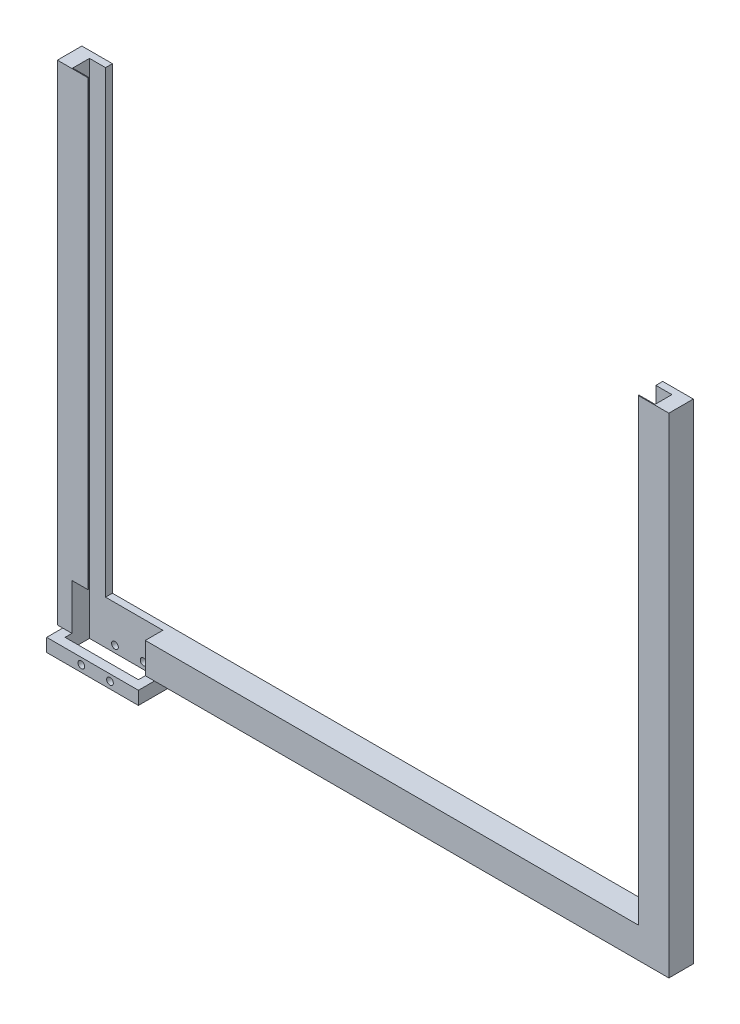
ISO-10303-21;
HEADER;
FILE_DESCRIPTION(('STEP AP214'),'2;1');
FILE_NAME('part.step','',(''),(''),'','','');
FILE_SCHEMA(('AUTOMOTIVE_DESIGN { 1 0 10303 214 1 1 1 1 }'));
ENDSEC;
DATA;
#1=APPLICATION_CONTEXT('core data for automotive mechanical design processes');
#2=APPLICATION_PROTOCOL_DEFINITION('international standard','automotive_design',2000,#1);
#3=PRODUCT_CONTEXT('',#1,'mechanical');
#4=PRODUCT('Part','Part','',(#3));
#5=PRODUCT_RELATED_PRODUCT_CATEGORY('part','',(#4));
#6=PRODUCT_DEFINITION_FORMATION('','',#4);
#7=PRODUCT_DEFINITION_CONTEXT('part definition',#1,'design');
#8=PRODUCT_DEFINITION('design','',#6,#7);
#9=PRODUCT_DEFINITION_SHAPE('','',#8);
#10=(LENGTH_UNIT() NAMED_UNIT(*) SI_UNIT(.MILLI.,.METRE.));
#11=(NAMED_UNIT(*) PLANE_ANGLE_UNIT() SI_UNIT($,.RADIAN.));
#12=(NAMED_UNIT(*) SI_UNIT($,.STERADIAN.) SOLID_ANGLE_UNIT());
#13=UNCERTAINTY_MEASURE_WITH_UNIT(LENGTH_MEASURE(1.E-05),#10,'distance_accuracy_value','');
#14=(GEOMETRIC_REPRESENTATION_CONTEXT(3) GLOBAL_UNCERTAINTY_ASSIGNED_CONTEXT((#13)) GLOBAL_UNIT_ASSIGNED_CONTEXT((#10,
#11,#12)) REPRESENTATION_CONTEXT('',''));
#15=CARTESIAN_POINT('',(0.,0.,0.));
#16=DIRECTION('',(0.,0.,1.));
#17=DIRECTION('',(1.,0.,0.));
#18=AXIS2_PLACEMENT_3D('',#15,#16,#17);
#19=CARTESIAN_POINT('',(0.,160.,0.));
#20=DIRECTION('',(0.,1.,0.));
#21=DIRECTION('',(0.,0.,1.));
#22=AXIS2_PLACEMENT_3D('',#19,#20,#21);
#23=PLANE('',#22);
#24=DIRECTION('',(-1.,0.,0.));
#25=VECTOR('',#24,1.);
#26=CARTESIAN_POINT('',(-99.9999999999999,160.,-77.));
#27=LINE('',#26,#25);
#28=CARTESIAN_POINT('',(100.,160.,-77.));
#29=VERTEX_POINT('',#28);
#30=CARTESIAN_POINT('',(89.9999999999999,160.,-77.));
#31=VERTEX_POINT('',#30);
#32=EDGE_CURVE('E11',#29,#31,#27,.T.);
#33=ORIENTED_EDGE('',*,*,#32,.F.);
#34=DIRECTION('',(0.,0.,-1.));
#35=VECTOR('',#34,1.);
#36=CARTESIAN_POINT('',(100.,160.,0.));
#37=LINE('',#36,#35);
#38=CARTESIAN_POINT('',(100.,160.,-85.));
#39=VERTEX_POINT('',#38);
#40=EDGE_CURVE('E451',#29,#39,#37,.T.);
#41=ORIENTED_EDGE('',*,*,#40,.T.);
#42=DIRECTION('',(-1.,0.,0.));
#43=VECTOR('',#42,1.);
#44=CARTESIAN_POINT('',(0.,160.,-85.));
#45=LINE('',#44,#43);
#46=CARTESIAN_POINT('',(89.9999999999999,160.,-85.));
#47=VERTEX_POINT('',#46);
#48=EDGE_CURVE('E448',#39,#47,#45,.T.);
#49=ORIENTED_EDGE('',*,*,#48,.T.);
#50=DIRECTION('',(0.,0.,-1.));
#51=VECTOR('',#50,1.);
#52=CARTESIAN_POINT('',(89.9999999999999,160.,0.));
#53=LINE('',#52,#51);
#54=CARTESIAN_POINT('',(89.9999999999999,160.,-82.75));
#55=VERTEX_POINT('',#54);
#56=EDGE_CURVE('E408',#55,#47,#53,.T.);
#57=ORIENTED_EDGE('',*,*,#56,.F.);
#58=DIRECTION('',(1.,0.,0.));
#59=VECTOR('',#58,1.);
#60=CARTESIAN_POINT('',(0.,160.,-82.75));
#61=LINE('',#60,#59);
#62=CARTESIAN_POINT('',(95.2499999999999,160.,-82.75));
#63=VERTEX_POINT('',#62);
#64=EDGE_CURVE('E365',#55,#63,#61,.T.);
#65=ORIENTED_EDGE('',*,*,#64,.T.);
#66=DIRECTION('',(0.,0.,-1.));
#67=VECTOR('',#66,1.);
#68=CARTESIAN_POINT('',(95.2500000000001,160.,-2.40338052489878E-13));
#69=LINE('',#68,#67);
#70=CARTESIAN_POINT('',(95.2499999999999,160.,-77.25));
#71=VERTEX_POINT('',#70);
#72=EDGE_CURVE('E401',#71,#63,#69,.T.);
#73=ORIENTED_EDGE('',*,*,#72,.F.);
#74=DIRECTION('',(1.,0.,0.));
#75=VECTOR('',#74,1.);
#76=CARTESIAN_POINT('',(0.,160.,-77.25));
#77=LINE('',#76,#75);
#78=CARTESIAN_POINT('',(89.9999999999999,160.,-77.25));
#79=VERTEX_POINT('',#78);
#80=EDGE_CURVE('E456',#79,#71,#77,.T.);
#81=ORIENTED_EDGE('',*,*,#80,.F.);
#82=EDGE_CURVE('E404',#31,#79,#53,.T.);
#83=ORIENTED_EDGE('',*,*,#82,.F.);
#84=EDGE_LOOP('',(#33,#41,#49,#57,#65,#73,#81,#83));
#85=FACE_BOUND('',#84,.T.);
#86=ADVANCED_FACE('F38',(#85),#23,.T.);
#87=CARTESIAN_POINT('',(0.,0.,0.));
#88=DIRECTION('',(0.,-1.,0.));
#89=DIRECTION('',(0.,0.,-1.));
#90=AXIS2_PLACEMENT_3D('',#87,#88,#89);
#91=PLANE('',#90);
#92=DIRECTION('',(1.,0.,0.));
#93=VECTOR('',#92,1.);
#94=CARTESIAN_POINT('',(100.,0.,-77.));
#95=LINE('',#94,#93);
#96=CARTESIAN_POINT('',(-99.9999999999999,0.,-77.));
#97=VERTEX_POINT('',#96);
#98=CARTESIAN_POINT('',(-98.2499999999999,0.,-77.));
#99=VERTEX_POINT('',#98);
#100=EDGE_CURVE('E42',#97,#99,#95,.T.);
#101=ORIENTED_EDGE('',*,*,#100,.F.);
#102=DIRECTION('',(0.,0.,1.));
#103=VECTOR('',#102,1.);
#104=CARTESIAN_POINT('',(-99.9999999999999,0.,85.));
#105=LINE('',#104,#103);
#106=CARTESIAN_POINT('',(-99.9999999999999,0.,-85.));
#107=VERTEX_POINT('',#106);
#108=EDGE_CURVE('E416',#107,#97,#105,.T.);
#109=ORIENTED_EDGE('',*,*,#108,.F.);
#110=DIRECTION('',(-1.,0.,0.));
#111=VECTOR('',#110,1.);
#112=CARTESIAN_POINT('',(-99.9999999999999,0.,-85.));
#113=LINE('',#112,#111);
#114=CARTESIAN_POINT('',(-98.2499999999999,0.,-85.));
#115=VERTEX_POINT('',#114);
#116=EDGE_CURVE('E427',#115,#107,#113,.T.);
#117=ORIENTED_EDGE('',*,*,#116,.F.);
#118=DIRECTION('',(0.,0.,-1.));
#119=VECTOR('',#118,1.);
#120=CARTESIAN_POINT('',(-98.2499999999999,0.,-85.25));
#121=LINE('',#120,#119);
#122=EDGE_CURVE('E317',#99,#115,#121,.T.);
#123=ORIENTED_EDGE('',*,*,#122,.F.);
#124=EDGE_LOOP('',(#101,#109,#117,#123));
#125=FACE_BOUND('',#124,.T.);
#126=ADVANCED_FACE('F505',(#125),#91,.T.);
#127=CARTESIAN_POINT('',(-89.9999999999999,160.,0.));
#128=DIRECTION('',(-1.,0.,0.));
#129=DIRECTION('',(0.,0.,1.));
#130=AXIS2_PLACEMENT_3D('',#127,#128,#129);
#131=PLANE('',#130);
#132=DIRECTION('',(0.,0.,-1.));
#133=VECTOR('',#132,1.);
#134=CARTESIAN_POINT('',(-89.9999999999999,160.,0.));
#135=LINE('',#134,#133);
#136=CARTESIAN_POINT('',(-89.9999999999999,160.,-77.));
#137=VERTEX_POINT('',#136);
#138=CARTESIAN_POINT('',(-89.9999999999999,160.,-77.25));
#139=VERTEX_POINT('',#138);
#140=EDGE_CURVE('E246',#137,#139,#135,.T.);
#141=ORIENTED_EDGE('',*,*,#140,.F.);
#142=DIRECTION('',(0.,-1.,0.));
#143=VECTOR('',#142,1.);
#144=CARTESIAN_POINT('',(-89.9999999999999,160.,-77.));
#145=LINE('',#144,#143);
#146=CARTESIAN_POINT('',(-89.9999999999999,15.,-77.));
#147=VERTEX_POINT('',#146);
#148=EDGE_CURVE('E263',#137,#147,#145,.T.);
#149=ORIENTED_EDGE('',*,*,#148,.T.);
#150=DIRECTION('',(0.,0.,1.));
#151=VECTOR('',#150,1.);
#152=CARTESIAN_POINT('',(-89.9999999999999,15.,0.));
#153=LINE('',#152,#151);
#154=CARTESIAN_POINT('',(-89.9999999999999,15.,-77.25));
#155=VERTEX_POINT('',#154);
#156=EDGE_CURVE('E293',#155,#147,#153,.T.);
#157=ORIENTED_EDGE('',*,*,#156,.F.);
#158=DIRECTION('',(0.,-1.,0.));
#159=VECTOR('',#158,1.);
#160=CARTESIAN_POINT('',(-89.9999999999999,180.,-77.25));
#161=LINE('',#160,#159);
#162=EDGE_CURVE('E245',#139,#155,#161,.T.);
#163=ORIENTED_EDGE('',*,*,#162,.F.);
#164=EDGE_LOOP('',(#141,#149,#157,#163));
#165=FACE_BOUND('',#164,.T.);
#166=ADVANCED_FACE('F539',(#165),#131,.F.);
#167=CARTESIAN_POINT('',(0.,180.,-77.25));
#168=DIRECTION('',(0.,0.,-1.));
#169=DIRECTION('',(-1.,0.,0.));
#170=AXIS2_PLACEMENT_3D('',#167,#168,#169);
#171=PLANE('',#170);
#172=ORIENTED_EDGE('',*,*,#162,.T.);
#173=DIRECTION('',(-1.,0.,0.));
#174=VECTOR('',#173,1.);
#175=CARTESIAN_POINT('',(0.,15.,-77.25));
#176=LINE('',#175,#174);
#177=CARTESIAN_POINT('',(-95.2499999999999,15.,-77.25));
#178=VERTEX_POINT('',#177);
#179=EDGE_CURVE('E230',#155,#178,#176,.T.);
#180=ORIENTED_EDGE('',*,*,#179,.T.);
#181=DIRECTION('',(0.,-1.,0.));
#182=VECTOR('',#181,1.);
#183=CARTESIAN_POINT('',(-95.2499999999999,180.,-77.25));
#184=LINE('',#183,#182);
#185=CARTESIAN_POINT('',(-95.2499999999999,160.,-77.25));
#186=VERTEX_POINT('',#185);
#187=EDGE_CURVE('E236',#186,#178,#184,.T.);
#188=ORIENTED_EDGE('',*,*,#187,.F.);
#189=DIRECTION('',(-1.,0.,0.));
#190=VECTOR('',#189,1.);
#191=CARTESIAN_POINT('',(0.,160.,-77.25));
#192=LINE('',#191,#190);
#193=EDGE_CURVE('E443',#139,#186,#192,.T.);
#194=ORIENTED_EDGE('',*,*,#193,.F.);
#195=EDGE_LOOP('',(#172,#180,#188,#194));
#196=FACE_BOUND('',#195,.T.);
#197=ADVANCED_FACE('F241',(#196),#171,.T.);
#198=CARTESIAN_POINT('',(-99.9999999999999,160.,-77.));
#199=VERTEX_POINT('',#198);
#200=EDGE_CURVE('E50',#137,#199,#27,.T.);
#201=ORIENTED_EDGE('',*,*,#200,.F.);
#202=ORIENTED_EDGE('',*,*,#140,.T.);
#203=ORIENTED_EDGE('',*,*,#193,.T.);
#204=DIRECTION('',(0.,0.,-1.));
#205=VECTOR('',#204,1.);
#206=CARTESIAN_POINT('',(-95.2500000000001,160.,-2.40338052489878E-13));
#207=LINE('',#206,#205);
#208=CARTESIAN_POINT('',(-95.2499999999999,160.,-82.75));
#209=VERTEX_POINT('',#208);
#210=EDGE_CURVE('E252',#186,#209,#207,.T.);
#211=ORIENTED_EDGE('',*,*,#210,.T.);
#212=DIRECTION('',(-1.,0.,0.));
#213=VECTOR('',#212,1.);
#214=CARTESIAN_POINT('',(0.,160.,-82.75));
#215=LINE('',#214,#213);
#216=CARTESIAN_POINT('',(-89.9999999999999,160.,-82.75));
#217=VERTEX_POINT('',#216);
#218=EDGE_CURVE('E272',#217,#209,#215,.T.);
#219=ORIENTED_EDGE('',*,*,#218,.F.);
#220=CARTESIAN_POINT('',(-89.9999999999999,160.,-85.));
#221=VERTEX_POINT('',#220);
#222=EDGE_CURVE('E441',#217,#221,#135,.T.);
#223=ORIENTED_EDGE('',*,*,#222,.T.);
#224=DIRECTION('',(-1.,0.,0.));
#225=VECTOR('',#224,1.);
#226=CARTESIAN_POINT('',(0.,160.,-85.));
#227=LINE('',#226,#225);
#228=CARTESIAN_POINT('',(-99.9999999999999,160.,-85.));
#229=VERTEX_POINT('',#228);
#230=EDGE_CURVE('E438',#221,#229,#227,.T.);
#231=ORIENTED_EDGE('',*,*,#230,.T.);
#232=DIRECTION('',(0.,0.,1.));
#233=VECTOR('',#232,1.);
#234=CARTESIAN_POINT('',(-99.9999999999999,160.,0.));
#235=LINE('',#234,#233);
#236=EDGE_CURVE('E409',#229,#199,#235,.T.);
#237=ORIENTED_EDGE('',*,*,#236,.T.);
#238=EDGE_LOOP('',(#201,#202,#203,#211,#219,#223,#231,#237));
#239=FACE_BOUND('',#238,.T.);
#240=ADVANCED_FACE('F535',(#239),#23,.T.);
#241=CARTESIAN_POINT('',(89.9999999999999,160.,0.));
#242=DIRECTION('',(-1.,0.,0.));
#243=DIRECTION('',(0.,0.,1.));
#244=AXIS2_PLACEMENT_3D('',#241,#242,#243);
#245=PLANE('',#244);
#246=DIRECTION('',(0.,0.,-1.));
#247=VECTOR('',#246,1.);
#248=CARTESIAN_POINT('',(89.9999999999999,10.,0.));
#249=LINE('',#248,#247);
#250=CARTESIAN_POINT('',(89.9999999999999,10.,-82.75));
#251=VERTEX_POINT('',#250);
#252=CARTESIAN_POINT('',(89.9999999999999,10.,-85.));
#253=VERTEX_POINT('',#252);
#254=EDGE_CURVE('E432',#251,#253,#249,.T.);
#255=ORIENTED_EDGE('',*,*,#254,.F.);
#256=DIRECTION('',(0.,1.,0.));
#257=VECTOR('',#256,1.);
#258=CARTESIAN_POINT('',(89.9999999999999,160.,-82.75));
#259=LINE('',#258,#257);
#260=EDGE_CURVE('E405',#251,#55,#259,.T.);
#261=ORIENTED_EDGE('',*,*,#260,.T.);
#262=ORIENTED_EDGE('',*,*,#56,.T.);
#263=DIRECTION('',(0.,-1.,0.));
#264=VECTOR('',#263,1.);
#265=CARTESIAN_POINT('',(89.9999999999999,160.,-85.));
#266=LINE('',#265,#264);
#267=EDGE_CURVE('E360',#47,#253,#266,.T.);
#268=ORIENTED_EDGE('',*,*,#267,.T.);
#269=EDGE_LOOP('',(#255,#261,#262,#268));
#270=FACE_BOUND('',#269,.T.);
#271=ADVANCED_FACE('F478',(#270),#245,.T.);
#272=CARTESIAN_POINT('',(0.,10.,0.));
#273=DIRECTION('',(0.,-1.,0.));
#274=DIRECTION('',(0.,0.,-1.));
#275=AXIS2_PLACEMENT_3D('',#272,#273,#274);
#276=PLANE('',#275);
#277=DIRECTION('',(0.,0.,-1.));
#278=VECTOR('',#277,1.);
#279=CARTESIAN_POINT('',(-71.2499999999999,10.,-82.75));
#280=LINE('',#279,#278);
#281=CARTESIAN_POINT('',(-71.2499999999999,10.,-77.));
#282=VERTEX_POINT('',#281);
#283=CARTESIAN_POINT('',(-71.2499999999999,10.,-82.75));
#284=VERTEX_POINT('',#283);
#285=EDGE_CURVE('E289',#282,#284,#280,.T.);
#286=ORIENTED_EDGE('',*,*,#285,.F.);
#287=DIRECTION('',(1.,0.,0.));
#288=VECTOR('',#287,1.);
#289=CARTESIAN_POINT('',(0.,10.,-77.));
#290=LINE('',#289,#288);
#291=CARTESIAN_POINT('',(89.9999999999999,10.,-77.));
#292=VERTEX_POINT('',#291);
#293=EDGE_CURVE('E356',#282,#292,#290,.T.);
#294=ORIENTED_EDGE('',*,*,#293,.T.);
#295=CARTESIAN_POINT('',(89.9999999999999,9.99999999999999,-77.25));
#296=VERTEX_POINT('',#295);
#297=EDGE_CURVE('E359',#292,#296,#249,.T.);
#298=ORIENTED_EDGE('',*,*,#297,.T.);
#299=DIRECTION('',(-1.,0.,0.));
#300=VECTOR('',#299,1.);
#301=CARTESIAN_POINT('',(0.,9.99999999999999,-77.25));
#302=LINE('',#301,#300);
#303=CARTESIAN_POINT('',(95.2499999999999,9.99999999999999,-77.25));
#304=VERTEX_POINT('',#303);
#305=EDGE_CURVE('E412',#304,#296,#302,.T.);
#306=ORIENTED_EDGE('',*,*,#305,.F.);
#307=DIRECTION('',(0.,0.,1.));
#308=VECTOR('',#307,1.);
#309=CARTESIAN_POINT('',(95.2500000000001,9.99999999999999,-2.40338052489878E-13));
#310=LINE('',#309,#308);
#311=CARTESIAN_POINT('',(95.2499999999999,9.99999999999999,-82.75));
#312=VERTEX_POINT('',#311);
#313=EDGE_CURVE('E260',#312,#304,#310,.T.);
#314=ORIENTED_EDGE('',*,*,#313,.F.);
#315=DIRECTION('',(-1.,0.,0.));
#316=VECTOR('',#315,1.);
#317=CARTESIAN_POINT('',(0.,9.99999999999999,-82.75));
#318=LINE('',#317,#316);
#319=EDGE_CURVE('E447',#312,#251,#318,.T.);
#320=ORIENTED_EDGE('',*,*,#319,.T.);
#321=ORIENTED_EDGE('',*,*,#254,.T.);
#322=DIRECTION('',(-1.,0.,0.));
#323=VECTOR('',#322,1.);
#324=CARTESIAN_POINT('',(-99.9999999999999,10.,-85.));
#325=LINE('',#324,#323);
#326=CARTESIAN_POINT('',(-89.9999999999999,10.,-85.));
#327=VERTEX_POINT('',#326);
#328=EDGE_CURVE('E429',#253,#327,#325,.T.);
#329=ORIENTED_EDGE('',*,*,#328,.T.);
#330=DIRECTION('',(0.,0.,-1.));
#331=VECTOR('',#330,1.);
#332=CARTESIAN_POINT('',(-89.9999999999999,10.,0.));
#333=LINE('',#332,#331);
#334=CARTESIAN_POINT('',(-89.9999999999999,9.99999999999999,-82.75));
#335=VERTEX_POINT('',#334);
#336=EDGE_CURVE('E266',#335,#327,#333,.T.);
#337=ORIENTED_EDGE('',*,*,#336,.F.);
#338=DIRECTION('',(-1.,0.,0.));
#339=VECTOR('',#338,1.);
#340=CARTESIAN_POINT('',(-95.2499999999999,10.,-82.75));
#341=LINE('',#340,#339);
#342=EDGE_CURVE('E285',#284,#335,#341,.T.);
#343=ORIENTED_EDGE('',*,*,#342,.F.);
#344=EDGE_LOOP('',(#286,#294,#298,#306,#314,#320,#321,#329,#337,#343));
#345=FACE_BOUND('',#344,.T.);
#346=ADVANCED_FACE('F469',(#345),#276,.F.);
#347=CARTESIAN_POINT('',(100.,10.,85.));
#348=DIRECTION('',(-1.,0.,0.));
#349=DIRECTION('',(0.,0.,1.));
#350=AXIS2_PLACEMENT_3D('',#347,#348,#349);
#351=PLANE('',#350);
#352=ORIENTED_EDGE('',*,*,#40,.F.);
#353=DIRECTION('',(0.,1.,0.));
#354=VECTOR('',#353,1.);
#355=CARTESIAN_POINT('',(100.,160.,-77.));
#356=LINE('',#355,#354);
#357=CARTESIAN_POINT('',(100.,0.,-77.));
#358=VERTEX_POINT('',#357);
#359=EDGE_CURVE('E48',#358,#29,#356,.T.);
#360=ORIENTED_EDGE('',*,*,#359,.F.);
#361=DIRECTION('',(0.,0.,-1.));
#362=VECTOR('',#361,1.);
#363=CARTESIAN_POINT('',(100.,0.,85.));
#364=LINE('',#363,#362);
#365=CARTESIAN_POINT('',(100.,0.,-85.));
#366=VERTEX_POINT('',#365);
#367=EDGE_CURVE('E426',#358,#366,#364,.T.);
#368=ORIENTED_EDGE('',*,*,#367,.T.);
#369=DIRECTION('',(0.,-1.,0.));
#370=VECTOR('',#369,1.);
#371=CARTESIAN_POINT('',(100.,10.,-85.));
#372=LINE('',#371,#370);
#373=EDGE_CURVE('E413',#39,#366,#372,.T.);
#374=ORIENTED_EDGE('',*,*,#373,.F.);
#375=EDGE_LOOP('',(#352,#360,#368,#374));
#376=FACE_BOUND('',#375,.T.);
#377=ADVANCED_FACE('F487',(#376),#351,.F.);
#378=CARTESIAN_POINT('',(-99.9999999999999,10.,-85.));
#379=DIRECTION('',(0.,0.,1.));
#380=DIRECTION('',(1.,0.,0.));
#381=AXIS2_PLACEMENT_3D('',#378,#379,#380);
#382=PLANE('',#381);
#383=CARTESIAN_POINT('',(-68.2499999999999,0.,-85.));
#384=VERTEX_POINT('',#383);
#385=EDGE_CURVE('E422',#366,#384,#113,.T.);
#386=ORIENTED_EDGE('',*,*,#385,.T.);
#387=EDGE_CURVE('E425',#384,#115,#113,.T.);
#388=ORIENTED_EDGE('',*,*,#387,.T.);
#389=ORIENTED_EDGE('',*,*,#116,.T.);
#390=DIRECTION('',(0.,-1.,0.));
#391=VECTOR('',#390,1.);
#392=CARTESIAN_POINT('',(-99.9999999999999,10.,-85.));
#393=LINE('',#392,#391);
#394=EDGE_CURVE('E267',#229,#107,#393,.T.);
#395=ORIENTED_EDGE('',*,*,#394,.F.);
#396=ORIENTED_EDGE('',*,*,#230,.F.);
#397=DIRECTION('',(0.,-1.,0.));
#398=VECTOR('',#397,1.);
#399=CARTESIAN_POINT('',(-89.9999999999999,160.,-85.));
#400=LINE('',#399,#398);
#401=EDGE_CURVE('E417',#221,#327,#400,.T.);
#402=ORIENTED_EDGE('',*,*,#401,.T.);
#403=ORIENTED_EDGE('',*,*,#328,.F.);
#404=ORIENTED_EDGE('',*,*,#267,.F.);
#405=ORIENTED_EDGE('',*,*,#48,.F.);
#406=ORIENTED_EDGE('',*,*,#373,.T.);
#407=EDGE_LOOP('',(#386,#388,#389,#395,#396,#402,#403,#404,#405,#406));
#408=FACE_BOUND('',#407,.T.);
#409=ADVANCED_FACE('F474',(#408),#382,.F.);
#410=CARTESIAN_POINT('',(-99.9999999999999,10.,85.));
#411=DIRECTION('',(1.,0.,0.));
#412=DIRECTION('',(0.,0.,-1.));
#413=AXIS2_PLACEMENT_3D('',#410,#411,#412);
#414=PLANE('',#413);
#415=ORIENTED_EDGE('',*,*,#108,.T.);
#416=DIRECTION('',(0.,-1.,0.));
#417=VECTOR('',#416,1.);
#418=CARTESIAN_POINT('',(-99.9999999999999,0.,-77.));
#419=LINE('',#418,#417);
#420=EDGE_CURVE('E375',#199,#97,#419,.T.);
#421=ORIENTED_EDGE('',*,*,#420,.F.);
#422=ORIENTED_EDGE('',*,*,#236,.F.);
#423=ORIENTED_EDGE('',*,*,#394,.T.);
#424=EDGE_LOOP('',(#415,#421,#422,#423));
#425=FACE_BOUND('',#424,.T.);
#426=ADVANCED_FACE('F504',(#425),#414,.F.);
#427=CARTESIAN_POINT('',(-68.2499999999999,0.,-77.));
#428=VERTEX_POINT('',#427);
#429=EDGE_CURVE('E376',#428,#358,#95,.T.);
#430=ORIENTED_EDGE('',*,*,#429,.F.);
#431=DIRECTION('',(0.,0.,1.));
#432=VECTOR('',#431,1.);
#433=CARTESIAN_POINT('',(-68.2499999999999,0.,-71.75));
#434=LINE('',#433,#432);
#435=EDGE_CURVE('E323',#384,#428,#434,.T.);
#436=ORIENTED_EDGE('',*,*,#435,.F.);
#437=ORIENTED_EDGE('',*,*,#385,.F.);
#438=ORIENTED_EDGE('',*,*,#367,.F.);
#439=EDGE_LOOP('',(#430,#436,#437,#438));
#440=FACE_BOUND('',#439,.T.);
#441=ADVANCED_FACE('F40',(#440),#91,.T.);
#442=ORIENTED_EDGE('',*,*,#222,.F.);
#443=DIRECTION('',(0.,-1.,0.));
#444=VECTOR('',#443,1.);
#445=CARTESIAN_POINT('',(-89.9999999999999,180.,-82.75));
#446=LINE('',#445,#444);
#447=EDGE_CURVE('E264',#217,#335,#446,.T.);
#448=ORIENTED_EDGE('',*,*,#447,.T.);
#449=ORIENTED_EDGE('',*,*,#336,.T.);
#450=ORIENTED_EDGE('',*,*,#401,.F.);
#451=EDGE_LOOP('',(#442,#448,#449,#450));
#452=FACE_BOUND('',#451,.T.);
#453=ADVANCED_FACE('F556',(#452),#131,.F.);
#454=DIRECTION('',(0.,-1.,0.));
#455=VECTOR('',#454,1.);
#456=CARTESIAN_POINT('',(89.9999999999999,160.,-77.));
#457=LINE('',#456,#455);
#458=EDGE_CURVE('E352',#31,#292,#457,.T.);
#459=ORIENTED_EDGE('',*,*,#458,.F.);
#460=ORIENTED_EDGE('',*,*,#82,.T.);
#461=DIRECTION('',(0.,1.,0.));
#462=VECTOR('',#461,1.);
#463=CARTESIAN_POINT('',(89.9999999999999,160.,-77.25));
#464=LINE('',#463,#462);
#465=EDGE_CURVE('E256',#296,#79,#464,.T.);
#466=ORIENTED_EDGE('',*,*,#465,.F.);
#467=ORIENTED_EDGE('',*,*,#297,.F.);
#468=EDGE_LOOP('',(#459,#460,#466,#467));
#469=FACE_BOUND('',#468,.T.);
#470=ADVANCED_FACE('F547',(#469),#245,.T.);
#471=CARTESIAN_POINT('',(95.2500000000001,180.,-2.40338052489878E-13));
#472=DIRECTION('',(1.,0.,0.));
#473=DIRECTION('',(0.,0.,-1.));
#474=AXIS2_PLACEMENT_3D('',#471,#472,#473);
#475=PLANE('',#474);
#476=ORIENTED_EDGE('',*,*,#72,.T.);
#477=DIRECTION('',(0.,-1.,0.));
#478=VECTOR('',#477,1.);
#479=CARTESIAN_POINT('',(95.2499999999999,180.,-82.75));
#480=LINE('',#479,#478);
#481=EDGE_CURVE('E403',#63,#312,#480,.T.);
#482=ORIENTED_EDGE('',*,*,#481,.T.);
#483=ORIENTED_EDGE('',*,*,#313,.T.);
#484=DIRECTION('',(0.,-1.,0.));
#485=VECTOR('',#484,1.);
#486=CARTESIAN_POINT('',(95.2499999999999,180.,-77.25));
#487=LINE('',#486,#485);
#488=EDGE_CURVE('E458',#71,#304,#487,.T.);
#489=ORIENTED_EDGE('',*,*,#488,.F.);
#490=EDGE_LOOP('',(#476,#482,#483,#489));
#491=FACE_BOUND('',#490,.T.);
#492=ADVANCED_FACE('F574',(#491),#475,.F.);
#493=CARTESIAN_POINT('',(0.,180.,-82.75));
#494=DIRECTION('',(0.,0.,1.));
#495=DIRECTION('',(1.,0.,0.));
#496=AXIS2_PLACEMENT_3D('',#493,#494,#495);
#497=PLANE('',#496);
#498=ORIENTED_EDGE('',*,*,#260,.F.);
#499=ORIENTED_EDGE('',*,*,#319,.F.);
#500=ORIENTED_EDGE('',*,*,#481,.F.);
#501=ORIENTED_EDGE('',*,*,#64,.F.);
#502=EDGE_LOOP('',(#498,#499,#500,#501));
#503=FACE_BOUND('',#502,.T.);
#504=ADVANCED_FACE('F577',(#503),#497,.T.);
#505=CARTESIAN_POINT('',(0.,180.,-77.25));
#506=DIRECTION('',(0.,0.,1.));
#507=DIRECTION('',(1.,0.,0.));
#508=AXIS2_PLACEMENT_3D('',#505,#506,#507);
#509=PLANE('',#508);
#510=ORIENTED_EDGE('',*,*,#80,.T.);
#511=ORIENTED_EDGE('',*,*,#488,.T.);
#512=ORIENTED_EDGE('',*,*,#305,.T.);
#513=ORIENTED_EDGE('',*,*,#465,.T.);
#514=EDGE_LOOP('',(#510,#511,#512,#513));
#515=FACE_BOUND('',#514,.T.);
#516=ADVANCED_FACE('F569',(#515),#509,.F.);
#517=CARTESIAN_POINT('',(-95.2500000000001,180.,-2.40338052489878E-13));
#518=DIRECTION('',(1.,0.,0.));
#519=DIRECTION('',(0.,0.,-1.));
#520=AXIS2_PLACEMENT_3D('',#517,#518,#519);
#521=PLANE('',#520);
#522=DIRECTION('',(0.,0.,-1.));
#523=VECTOR('',#522,1.);
#524=CARTESIAN_POINT('',(-95.2500000000001,0.,-2.40338052489878E-13));
#525=LINE('',#524,#523);
#526=CARTESIAN_POINT('',(-95.2499999999999,0.,-74.75));
#527=VERTEX_POINT('',#526);
#528=CARTESIAN_POINT('',(-95.2499999999999,0.,-77.));
#529=VERTEX_POINT('',#528);
#530=EDGE_CURVE('E355',#527,#529,#525,.T.);
#531=ORIENTED_EDGE('',*,*,#530,.F.);
#532=DIRECTION('',(0.,1.,0.));
#533=VECTOR('',#532,1.);
#534=CARTESIAN_POINT('',(-95.2499999999999,-20.,-74.75));
#535=LINE('',#534,#533);
#536=CARTESIAN_POINT('',(-95.2499999999999,-4.3,-74.75));
#537=VERTEX_POINT('',#536);
#538=EDGE_CURVE('E273',#537,#527,#535,.T.);
#539=ORIENTED_EDGE('',*,*,#538,.F.);
#540=DIRECTION('',(0.,0.,-1.));
#541=VECTOR('',#540,1.);
#542=CARTESIAN_POINT('',(-95.2499999999999,-4.3,-82.75));
#543=LINE('',#542,#541);
#544=CARTESIAN_POINT('',(-95.2499999999999,-4.3,-82.75));
#545=VERTEX_POINT('',#544);
#546=EDGE_CURVE('E253',#537,#545,#543,.T.);
#547=ORIENTED_EDGE('',*,*,#546,.T.);
#548=DIRECTION('',(0.,-1.,0.));
#549=VECTOR('',#548,1.);
#550=CARTESIAN_POINT('',(-95.2499999999999,180.,-82.75));
#551=LINE('',#550,#549);
#552=EDGE_CURVE('E268',#209,#545,#551,.T.);
#553=ORIENTED_EDGE('',*,*,#552,.F.);
#554=ORIENTED_EDGE('',*,*,#210,.F.);
#555=ORIENTED_EDGE('',*,*,#187,.T.);
#556=DIRECTION('',(0.,0.,1.));
#557=VECTOR('',#556,1.);
#558=CARTESIAN_POINT('',(-95.2499999999999,15.,-74.75));
#559=LINE('',#558,#557);
#560=CARTESIAN_POINT('',(-95.2499999999999,15.,-77.));
#561=VERTEX_POINT('',#560);
#562=EDGE_CURVE('E226',#178,#561,#559,.T.);
#563=ORIENTED_EDGE('',*,*,#562,.T.);
#564=DIRECTION('',(0.,1.,0.));
#565=VECTOR('',#564,1.);
#566=CARTESIAN_POINT('',(-95.2499999999999,180.,-77.));
#567=LINE('',#566,#565);
#568=EDGE_CURVE('E147',#529,#561,#567,.T.);
#569=ORIENTED_EDGE('',*,*,#568,.F.);
#570=EDGE_LOOP('',(#531,#539,#547,#553,#554,#555,#563,#569));
#571=FACE_BOUND('',#570,.T.);
#572=ADVANCED_FACE('F249',(#571),#521,.T.);
#573=CARTESIAN_POINT('',(0.,180.,-82.75));
#574=DIRECTION('',(0.,0.,-1.));
#575=DIRECTION('',(-1.,0.,0.));
#576=AXIS2_PLACEMENT_3D('',#573,#574,#575);
#577=PLANE('',#576);
#578=CARTESIAN_POINT('',(-77.5499999999999,-2.1,-82.75));
#579=DIRECTION('',(0.,0.,-1.));
#580=DIRECTION('',(-1.,0.,0.));
#581=AXIS2_PLACEMENT_3D('',#578,#579,#580);
#582=CIRCLE('',#581,1.10000000000001);
#583=CARTESIAN_POINT('',(-78.6499999999999,-2.1,-82.75));
#584=VERTEX_POINT('',#583);
#585=EDGE_CURVE('E235',#584,#584,#582,.T.);
#586=ORIENTED_EDGE('',*,*,#585,.T.);
#587=EDGE_LOOP('',(#586));
#588=FACE_BOUND('',#587,.T.);
#589=CARTESIAN_POINT('',(-86.9299999999999,-2.1,-82.75));
#590=DIRECTION('',(0.,0.,-1.));
#591=DIRECTION('',(-1.,0.,0.));
#592=AXIS2_PLACEMENT_3D('',#589,#590,#591);
#593=CIRCLE('',#592,1.10000000000001);
#594=CARTESIAN_POINT('',(-88.0299999999999,-2.1,-82.75));
#595=VERTEX_POINT('',#594);
#596=EDGE_CURVE('E288',#595,#595,#593,.T.);
#597=ORIENTED_EDGE('',*,*,#596,.T.);
#598=EDGE_LOOP('',(#597));
#599=FACE_BOUND('',#598,.T.);
#600=ORIENTED_EDGE('',*,*,#342,.T.);
#601=ORIENTED_EDGE('',*,*,#447,.F.);
#602=ORIENTED_EDGE('',*,*,#218,.T.);
#603=ORIENTED_EDGE('',*,*,#552,.T.);
#604=DIRECTION('',(1.,0.,0.));
#605=VECTOR('',#604,1.);
#606=CARTESIAN_POINT('',(-71.2499999999999,-4.3,-82.75));
#607=LINE('',#606,#605);
#608=CARTESIAN_POINT('',(-71.2499999999999,-4.3,-82.75));
#609=VERTEX_POINT('',#608);
#610=EDGE_CURVE('E271',#545,#609,#607,.T.);
#611=ORIENTED_EDGE('',*,*,#610,.T.);
#612=DIRECTION('',(0.,1.,0.));
#613=VECTOR('',#612,1.);
#614=CARTESIAN_POINT('',(-71.2499999999999,-20.,-82.75));
#615=LINE('',#614,#613);
#616=EDGE_CURVE('E282',#609,#284,#615,.T.);
#617=ORIENTED_EDGE('',*,*,#616,.T.);
#618=EDGE_LOOP('',(#600,#601,#602,#603,#611,#617));
#619=FACE_BOUND('',#618,.T.);
#620=ADVANCED_FACE('F393',(#588,#599,#619),#577,.F.);
#621=CARTESIAN_POINT('',(-71.2499999999999,-20.,-82.75));
#622=DIRECTION('',(1.,0.,0.));
#623=DIRECTION('',(0.,0.,-1.));
#624=AXIS2_PLACEMENT_3D('',#621,#622,#623);
#625=PLANE('',#624);
#626=DIRECTION('',(0.,1.,0.));
#627=VECTOR('',#626,1.);
#628=CARTESIAN_POINT('',(-71.2499999999999,-20.,-74.75));
#629=LINE('',#628,#627);
#630=CARTESIAN_POINT('',(-71.2499999999999,-4.3,-74.75));
#631=VERTEX_POINT('',#630);
#632=CARTESIAN_POINT('',(-71.2499999999999,0.,-74.75));
#633=VERTEX_POINT('',#632);
#634=EDGE_CURVE('E278',#631,#633,#629,.T.);
#635=ORIENTED_EDGE('',*,*,#634,.T.);
#636=DIRECTION('',(0.,0.,-1.));
#637=VECTOR('',#636,1.);
#638=CARTESIAN_POINT('',(-71.2499999999999,0.,-82.75));
#639=LINE('',#638,#637);
#640=CARTESIAN_POINT('',(-71.2499999999999,0.,-77.));
#641=VERTEX_POINT('',#640);
#642=EDGE_CURVE('E281',#633,#641,#639,.T.);
#643=ORIENTED_EDGE('',*,*,#642,.T.);
#644=DIRECTION('',(0.,1.,0.));
#645=VECTOR('',#644,1.);
#646=CARTESIAN_POINT('',(-71.2499999999999,-20.,-77.));
#647=LINE('',#646,#645);
#648=EDGE_CURVE('E292',#641,#282,#647,.T.);
#649=ORIENTED_EDGE('',*,*,#648,.T.);
#650=ORIENTED_EDGE('',*,*,#285,.T.);
#651=ORIENTED_EDGE('',*,*,#616,.F.);
#652=DIRECTION('',(0.,0.,1.));
#653=VECTOR('',#652,1.);
#654=CARTESIAN_POINT('',(-71.2499999999999,-4.3,-74.75));
#655=LINE('',#654,#653);
#656=EDGE_CURVE('E291',#609,#631,#655,.T.);
#657=ORIENTED_EDGE('',*,*,#656,.T.);
#658=EDGE_LOOP('',(#635,#643,#649,#650,#651,#657));
#659=FACE_BOUND('',#658,.T.);
#660=ADVANCED_FACE('F559',(#659),#625,.F.);
#661=CARTESIAN_POINT('',(-71.2499999999999,-20.,-74.75));
#662=DIRECTION('',(0.,0.,1.));
#663=DIRECTION('',(1.,0.,0.));
#664=AXIS2_PLACEMENT_3D('',#661,#662,#663);
#665=PLANE('',#664);
#666=CARTESIAN_POINT('',(-77.5499999999999,-2.1,-74.75));
#667=DIRECTION('',(0.,0.,1.));
#668=DIRECTION('',(1.,0.,0.));
#669=AXIS2_PLACEMENT_3D('',#666,#667,#668);
#670=CIRCLE('',#669,1.10000000000001);
#671=CARTESIAN_POINT('',(-76.4499999999999,-2.1,-74.75));
#672=VERTEX_POINT('',#671);
#673=EDGE_CURVE('E338',#672,#672,#670,.T.);
#674=ORIENTED_EDGE('',*,*,#673,.T.);
#675=EDGE_LOOP('',(#674));
#676=FACE_BOUND('',#675,.T.);
#677=CARTESIAN_POINT('',(-86.9299999999999,-2.1,-74.75));
#678=DIRECTION('',(0.,0.,1.));
#679=DIRECTION('',(1.,0.,0.));
#680=AXIS2_PLACEMENT_3D('',#677,#678,#679);
#681=CIRCLE('',#680,1.10000000000001);
#682=CARTESIAN_POINT('',(-85.8299999999999,-2.1,-74.75));
#683=VERTEX_POINT('',#682);
#684=EDGE_CURVE('E277',#683,#683,#681,.T.);
#685=ORIENTED_EDGE('',*,*,#684,.T.);
#686=EDGE_LOOP('',(#685));
#687=FACE_BOUND('',#686,.T.);
#688=ORIENTED_EDGE('',*,*,#538,.T.);
#689=DIRECTION('',(1.,0.,0.));
#690=VECTOR('',#689,1.);
#691=CARTESIAN_POINT('',(-71.2499999999999,0.,-74.75));
#692=LINE('',#691,#690);
#693=EDGE_CURVE('E276',#527,#633,#692,.T.);
#694=ORIENTED_EDGE('',*,*,#693,.T.);
#695=ORIENTED_EDGE('',*,*,#634,.F.);
#696=DIRECTION('',(-1.,0.,0.));
#697=VECTOR('',#696,1.);
#698=CARTESIAN_POINT('',(-95.2499999999999,-4.3,-74.75));
#699=LINE('',#698,#697);
#700=EDGE_CURVE('E295',#631,#537,#699,.T.);
#701=ORIENTED_EDGE('',*,*,#700,.T.);
#702=EDGE_LOOP('',(#688,#694,#695,#701));
#703=FACE_BOUND('',#702,.T.);
#704=ADVANCED_FACE('F385',(#676,#687,#703),#665,.F.);
#705=CARTESIAN_POINT('',(0.,15.,0.));
#706=DIRECTION('',(0.,-1.,0.));
#707=DIRECTION('',(0.,0.,-1.));
#708=AXIS2_PLACEMENT_3D('',#705,#706,#707);
#709=PLANE('',#708);
#710=DIRECTION('',(1.,0.,0.));
#711=VECTOR('',#710,1.);
#712=CARTESIAN_POINT('',(0.,15.,-77.));
#713=LINE('',#712,#711);
#714=EDGE_CURVE('E232',#561,#147,#713,.T.);
#715=ORIENTED_EDGE('',*,*,#714,.F.);
#716=ORIENTED_EDGE('',*,*,#562,.F.);
#717=ORIENTED_EDGE('',*,*,#179,.F.);
#718=ORIENTED_EDGE('',*,*,#156,.T.);
#719=EDGE_LOOP('',(#715,#716,#717,#718));
#720=FACE_BOUND('',#719,.T.);
#721=ADVANCED_FACE('F228',(#720),#709,.T.);
#722=CARTESIAN_POINT('',(0.,0.,0.));
#723=DIRECTION('',(0.,1.,0.));
#724=DIRECTION('',(0.,0.,1.));
#725=AXIS2_PLACEMENT_3D('',#722,#723,#724);
#726=PLANE('',#725);
#727=ORIENTED_EDGE('',*,*,#387,.F.);
#728=CARTESIAN_POINT('',(-68.2499999999999,0.,-85.25));
#729=VERTEX_POINT('',#728);
#730=EDGE_CURVE('E320',#729,#384,#434,.T.);
#731=ORIENTED_EDGE('',*,*,#730,.F.);
#732=DIRECTION('',(1.,0.,0.));
#733=VECTOR('',#732,1.);
#734=CARTESIAN_POINT('',(-68.2499999999999,0.,-85.25));
#735=LINE('',#734,#733);
#736=CARTESIAN_POINT('',(-98.2499999999999,0.,-85.25));
#737=VERTEX_POINT('',#736);
#738=EDGE_CURVE('E103',#737,#729,#735,.T.);
#739=ORIENTED_EDGE('',*,*,#738,.F.);
#740=EDGE_CURVE('E306',#115,#737,#121,.T.);
#741=ORIENTED_EDGE('',*,*,#740,.F.);
#742=EDGE_LOOP('',(#727,#731,#739,#741));
#743=FACE_BOUND('',#742,.T.);
#744=ADVANCED_FACE('F497',(#743),#726,.T.);
#745=CARTESIAN_POINT('',(0.,-4.3,0.));
#746=DIRECTION('',(0.,1.,0.));
#747=DIRECTION('',(0.,0.,1.));
#748=AXIS2_PLACEMENT_3D('',#745,#746,#747);
#749=PLANE('',#748);
#750=DIRECTION('',(0.,0.,1.));
#751=VECTOR('',#750,1.);
#752=CARTESIAN_POINT('',(-68.2499999999999,-4.3,-71.75));
#753=LINE('',#752,#751);
#754=CARTESIAN_POINT('',(-68.2499999999999,-4.3,-85.25));
#755=VERTEX_POINT('',#754);
#756=CARTESIAN_POINT('',(-68.2499999999999,-4.3,-71.75));
#757=VERTEX_POINT('',#756);
#758=EDGE_CURVE('E294',#755,#757,#753,.T.);
#759=ORIENTED_EDGE('',*,*,#758,.T.);
#760=DIRECTION('',(-1.,0.,0.));
#761=VECTOR('',#760,1.);
#762=CARTESIAN_POINT('',(-98.2499999999999,-4.3,-71.75));
#763=LINE('',#762,#761);
#764=CARTESIAN_POINT('',(-98.2499999999999,-4.3,-71.75));
#765=VERTEX_POINT('',#764);
#766=EDGE_CURVE('E328',#757,#765,#763,.T.);
#767=ORIENTED_EDGE('',*,*,#766,.T.);
#768=DIRECTION('',(0.,0.,-1.));
#769=VECTOR('',#768,1.);
#770=CARTESIAN_POINT('',(-98.2499999999999,-4.3,-85.25));
#771=LINE('',#770,#769);
#772=CARTESIAN_POINT('',(-98.2499999999999,-4.3,-85.25));
#773=VERTEX_POINT('',#772);
#774=EDGE_CURVE('E326',#765,#773,#771,.T.);
#775=ORIENTED_EDGE('',*,*,#774,.T.);
#776=DIRECTION('',(1.,0.,0.));
#777=VECTOR('',#776,1.);
#778=CARTESIAN_POINT('',(-68.2499999999999,-4.3,-85.25));
#779=LINE('',#778,#777);
#780=EDGE_CURVE('E324',#773,#755,#779,.T.);
#781=ORIENTED_EDGE('',*,*,#780,.T.);
#782=EDGE_LOOP('',(#759,#767,#775,#781));
#783=FACE_BOUND('',#782,.T.);
#784=ORIENTED_EDGE('',*,*,#656,.F.);
#785=ORIENTED_EDGE('',*,*,#610,.F.);
#786=ORIENTED_EDGE('',*,*,#546,.F.);
#787=ORIENTED_EDGE('',*,*,#700,.F.);
#788=EDGE_LOOP('',(#784,#785,#786,#787));
#789=FACE_BOUND('',#788,.T.);
#790=ADVANCED_FACE('F391',(#783,#789),#749,.F.);
#791=CARTESIAN_POINT('',(-68.2499999999999,-4.3,-71.75));
#792=DIRECTION('',(-1.,0.,0.));
#793=DIRECTION('',(0.,0.,1.));
#794=AXIS2_PLACEMENT_3D('',#791,#792,#793);
#795=PLANE('',#794);
#796=ORIENTED_EDGE('',*,*,#730,.T.);
#797=ORIENTED_EDGE('',*,*,#435,.T.);
#798=DIRECTION('',(0.,0.,1.));
#799=VECTOR('',#798,1.);
#800=CARTESIAN_POINT('',(-68.2499999999999,0.,-71.75));
#801=LINE('',#800,#799);
#802=CARTESIAN_POINT('',(-68.2499999999999,0.,-71.75));
#803=VERTEX_POINT('',#802);
#804=EDGE_CURVE('E312',#428,#803,#801,.T.);
#805=ORIENTED_EDGE('',*,*,#804,.T.);
#806=DIRECTION('',(0.,1.,0.));
#807=VECTOR('',#806,1.);
#808=CARTESIAN_POINT('',(-68.2499999999999,-4.3,-71.75));
#809=LINE('',#808,#807);
#810=EDGE_CURVE('E297',#757,#803,#809,.T.);
#811=ORIENTED_EDGE('',*,*,#810,.F.);
#812=ORIENTED_EDGE('',*,*,#758,.F.);
#813=DIRECTION('',(0.,1.,0.));
#814=VECTOR('',#813,1.);
#815=CARTESIAN_POINT('',(-68.2499999999999,-4.3,-85.25));
#816=LINE('',#815,#814);
#817=EDGE_CURVE('E310',#755,#729,#816,.T.);
#818=ORIENTED_EDGE('',*,*,#817,.T.);
#819=EDGE_LOOP('',(#796,#797,#805,#811,#812,#818));
#820=FACE_BOUND('',#819,.T.);
#821=ADVANCED_FACE('F492',(#820),#795,.F.);
#822=CARTESIAN_POINT('',(-98.2499999999999,-4.3,-71.75));
#823=DIRECTION('',(0.,0.,-1.));
#824=DIRECTION('',(-1.,0.,0.));
#825=AXIS2_PLACEMENT_3D('',#822,#823,#824);
#826=PLANE('',#825);
#827=CARTESIAN_POINT('',(-77.5499999999999,-2.1,-71.75));
#828=DIRECTION('',(0.,0.,1.));
#829=DIRECTION('',(1.,0.,0.));
#830=AXIS2_PLACEMENT_3D('',#827,#828,#829);
#831=CIRCLE('',#830,1.10000000000001);
#832=CARTESIAN_POINT('',(-76.4499999999999,-2.1,-71.75));
#833=VERTEX_POINT('',#832);
#834=EDGE_CURVE('E349',#833,#833,#831,.T.);
#835=ORIENTED_EDGE('',*,*,#834,.F.);
#836=EDGE_LOOP('',(#835));
#837=FACE_BOUND('',#836,.T.);
#838=CARTESIAN_POINT('',(-86.9299999999999,-2.1,-71.75));
#839=DIRECTION('',(0.,0.,1.));
#840=DIRECTION('',(1.,0.,0.));
#841=AXIS2_PLACEMENT_3D('',#838,#839,#840);
#842=CIRCLE('',#841,1.10000000000001);
#843=CARTESIAN_POINT('',(-85.8299999999999,-2.1,-71.75));
#844=VERTEX_POINT('',#843);
#845=EDGE_CURVE('E309',#844,#844,#842,.T.);
#846=ORIENTED_EDGE('',*,*,#845,.F.);
#847=EDGE_LOOP('',(#846));
#848=FACE_BOUND('',#847,.T.);
#849=DIRECTION('',(-1.,0.,0.));
#850=VECTOR('',#849,1.);
#851=CARTESIAN_POINT('',(-98.2499999999999,0.,-71.75));
#852=LINE('',#851,#850);
#853=CARTESIAN_POINT('',(-98.2499999999999,0.,-71.75));
#854=VERTEX_POINT('',#853);
#855=EDGE_CURVE('E301',#803,#854,#852,.T.);
#856=ORIENTED_EDGE('',*,*,#855,.T.);
#857=DIRECTION('',(0.,1.,0.));
#858=VECTOR('',#857,1.);
#859=CARTESIAN_POINT('',(-98.2499999999999,-4.3,-71.75));
#860=LINE('',#859,#858);
#861=EDGE_CURVE('E302',#765,#854,#860,.T.);
#862=ORIENTED_EDGE('',*,*,#861,.F.);
#863=ORIENTED_EDGE('',*,*,#766,.F.);
#864=ORIENTED_EDGE('',*,*,#810,.T.);
#865=EDGE_LOOP('',(#856,#862,#863,#864));
#866=FACE_BOUND('',#865,.T.);
#867=ADVANCED_FACE('F512',(#837,#848,#866),#826,.F.);
#868=CARTESIAN_POINT('',(-98.2499999999999,-4.3,-85.25));
#869=DIRECTION('',(1.,0.,0.));
#870=DIRECTION('',(0.,0.,-1.));
#871=AXIS2_PLACEMENT_3D('',#868,#869,#870);
#872=PLANE('',#871);
#873=EDGE_CURVE('E300',#854,#99,#121,.T.);
#874=ORIENTED_EDGE('',*,*,#873,.T.);
#875=ORIENTED_EDGE('',*,*,#122,.T.);
#876=ORIENTED_EDGE('',*,*,#740,.T.);
#877=DIRECTION('',(0.,1.,0.));
#878=VECTOR('',#877,1.);
#879=CARTESIAN_POINT('',(-98.2499999999999,-4.3,-85.25));
#880=LINE('',#879,#878);
#881=EDGE_CURVE('E307',#773,#737,#880,.T.);
#882=ORIENTED_EDGE('',*,*,#881,.F.);
#883=ORIENTED_EDGE('',*,*,#774,.F.);
#884=ORIENTED_EDGE('',*,*,#861,.T.);
#885=EDGE_LOOP('',(#874,#875,#876,#882,#883,#884));
#886=FACE_BOUND('',#885,.T.);
#887=ADVANCED_FACE('F507',(#886),#872,.F.);
#888=CARTESIAN_POINT('',(-68.2499999999999,-4.3,-85.25));
#889=DIRECTION('',(0.,0.,1.));
#890=DIRECTION('',(1.,0.,0.));
#891=AXIS2_PLACEMENT_3D('',#888,#889,#890);
#892=PLANE('',#891);
#893=CARTESIAN_POINT('',(-77.5499999999999,-2.1,-85.25));
#894=DIRECTION('',(0.,0.,1.));
#895=DIRECTION('',(1.,0.,0.));
#896=AXIS2_PLACEMENT_3D('',#893,#894,#895);
#897=CIRCLE('',#896,1.10000000000001);
#898=CARTESIAN_POINT('',(-76.4499999999999,-2.1,-85.25));
#899=VERTEX_POINT('',#898);
#900=EDGE_CURVE('E305',#899,#899,#897,.T.);
#901=ORIENTED_EDGE('',*,*,#900,.T.);
#902=EDGE_LOOP('',(#901));
#903=FACE_BOUND('',#902,.T.);
#904=CARTESIAN_POINT('',(-86.9299999999999,-2.1,-85.25));
#905=DIRECTION('',(0.,0.,1.));
#906=DIRECTION('',(1.,0.,0.));
#907=AXIS2_PLACEMENT_3D('',#904,#905,#906);
#908=CIRCLE('',#907,1.10000000000001);
#909=CARTESIAN_POINT('',(-85.8299999999999,-2.1,-85.25));
#910=VERTEX_POINT('',#909);
#911=EDGE_CURVE('E314',#910,#910,#908,.T.);
#912=ORIENTED_EDGE('',*,*,#911,.T.);
#913=EDGE_LOOP('',(#912));
#914=FACE_BOUND('',#913,.T.);
#915=ORIENTED_EDGE('',*,*,#738,.T.);
#916=ORIENTED_EDGE('',*,*,#817,.F.);
#917=ORIENTED_EDGE('',*,*,#780,.F.);
#918=ORIENTED_EDGE('',*,*,#881,.T.);
#919=EDGE_LOOP('',(#915,#916,#917,#918));
#920=FACE_BOUND('',#919,.T.);
#921=ADVANCED_FACE('F516',(#903,#914,#920),#892,.F.);
#922=CARTESIAN_POINT('',(-86.9299999999999,-2.1,-86.05));
#923=DIRECTION('',(0.,0.,1.));
#924=DIRECTION('',(1.,0.,0.));
#925=AXIS2_PLACEMENT_3D('',#922,#923,#924);
#926=CYLINDRICAL_SURFACE('',#925,1.10000000000001);
#927=ORIENTED_EDGE('',*,*,#911,.F.);
#928=EDGE_LOOP('',(#927));
#929=FACE_BOUND('',#928,.T.);
#930=ORIENTED_EDGE('',*,*,#596,.F.);
#931=EDGE_LOOP('',(#930));
#932=FACE_BOUND('',#931,.T.);
#933=ADVANCED_FACE('F518',(#929,#932),#926,.F.);
#934=CARTESIAN_POINT('',(-77.5499999999999,-2.1,-86.05));
#935=DIRECTION('',(0.,0.,1.));
#936=DIRECTION('',(1.,0.,0.));
#937=AXIS2_PLACEMENT_3D('',#934,#935,#936);
#938=CYLINDRICAL_SURFACE('',#937,1.10000000000001);
#939=ORIENTED_EDGE('',*,*,#900,.F.);
#940=EDGE_LOOP('',(#939));
#941=FACE_BOUND('',#940,.T.);
#942=ORIENTED_EDGE('',*,*,#585,.F.);
#943=EDGE_LOOP('',(#942));
#944=FACE_BOUND('',#943,.T.);
#945=ADVANCED_FACE('F525',(#941,#944),#938,.F.);
#946=ORIENTED_EDGE('',*,*,#845,.T.);
#947=EDGE_LOOP('',(#946));
#948=FACE_BOUND('',#947,.T.);
#949=ORIENTED_EDGE('',*,*,#684,.F.);
#950=EDGE_LOOP('',(#949));
#951=FACE_BOUND('',#950,.T.);
#952=ADVANCED_FACE('F528',(#948,#951),#926,.F.);
#953=ORIENTED_EDGE('',*,*,#834,.T.);
#954=EDGE_LOOP('',(#953));
#955=FACE_BOUND('',#954,.T.);
#956=ORIENTED_EDGE('',*,*,#673,.F.);
#957=EDGE_LOOP('',(#956));
#958=FACE_BOUND('',#957,.T.);
#959=ADVANCED_FACE('F611',(#955,#958),#938,.F.);
#960=CARTESIAN_POINT('',(0.,0.,-77.));
#961=DIRECTION('',(0.,0.,-1.));
#962=DIRECTION('',(-1.,0.,0.));
#963=AXIS2_PLACEMENT_3D('',#960,#961,#962);
#964=PLANE('',#963);
#965=ORIENTED_EDGE('',*,*,#200,.T.);
#966=ORIENTED_EDGE('',*,*,#420,.T.);
#967=ORIENTED_EDGE('',*,*,#100,.T.);
#968=EDGE_CURVE('E367',#99,#529,#95,.T.);
#969=ORIENTED_EDGE('',*,*,#968,.T.);
#970=ORIENTED_EDGE('',*,*,#568,.T.);
#971=ORIENTED_EDGE('',*,*,#714,.T.);
#972=ORIENTED_EDGE('',*,*,#148,.F.);
#973=EDGE_LOOP('',(#965,#966,#967,#969,#970,#971,#972));
#974=FACE_BOUND('',#973,.T.);
#975=ADVANCED_FACE('F381',(#974),#964,.F.);
#976=CARTESIAN_POINT('',(100.,0.,-77.));
#977=DIRECTION('',(0.,-1.,0.));
#978=DIRECTION('',(0.,0.,-1.));
#979=AXIS2_PLACEMENT_3D('',#976,#977,#978);
#980=PLANE('',#979);
#981=ORIENTED_EDGE('',*,*,#530,.T.);
#982=ORIENTED_EDGE('',*,*,#968,.F.);
#983=ORIENTED_EDGE('',*,*,#873,.F.);
#984=ORIENTED_EDGE('',*,*,#855,.F.);
#985=ORIENTED_EDGE('',*,*,#804,.F.);
#986=EDGE_CURVE('E354',#641,#428,#95,.T.);
#987=ORIENTED_EDGE('',*,*,#986,.F.);
#988=ORIENTED_EDGE('',*,*,#642,.F.);
#989=ORIENTED_EDGE('',*,*,#693,.F.);
#990=EDGE_LOOP('',(#981,#982,#983,#984,#985,#987,#988,#989));
#991=FACE_BOUND('',#990,.T.);
#992=ADVANCED_FACE('F510',(#991),#980,.F.);
#993=ORIENTED_EDGE('',*,*,#458,.T.);
#994=ORIENTED_EDGE('',*,*,#293,.F.);
#995=ORIENTED_EDGE('',*,*,#648,.F.);
#996=ORIENTED_EDGE('',*,*,#986,.T.);
#997=ORIENTED_EDGE('',*,*,#429,.T.);
#998=ORIENTED_EDGE('',*,*,#359,.T.);
#999=ORIENTED_EDGE('',*,*,#32,.T.);
#1000=EDGE_LOOP('',(#993,#994,#995,#996,#997,#998,#999));
#1001=FACE_BOUND('',#1000,.T.);
#1002=ADVANCED_FACE('F561',(#1001),#964,.F.);
#1003=CLOSED_SHELL('',(#86,#126,#166,#197,#240,#271,#346,#377,#409,#426,#441,#453,#470,#492,
#504,#516,#572,#620,#660,#704,#721,#744,#790,#821,#867,#887,#921,#933,#945,#952,#959,#975,#992,#1002));
#1004=MANIFOLD_SOLID_BREP('B2',#1003);
#1005=ADVANCED_BREP_SHAPE_REPRESENTATION('',(#18,#1004),#14);
#1006=SHAPE_DEFINITION_REPRESENTATION(#9,#1005);
ENDSEC;
END-ISO-10303-21;
